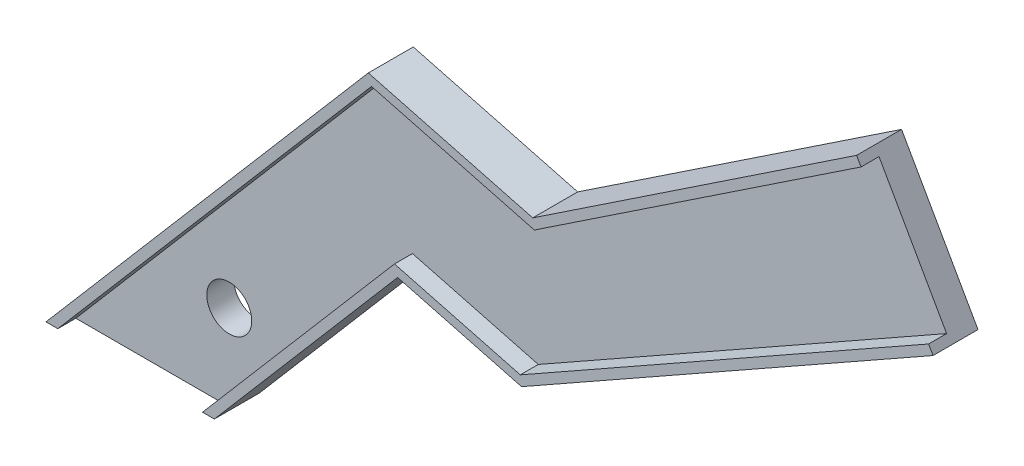
ISO-10303-21;
HEADER;
FILE_DESCRIPTION(('STEP AP214'),'2;1');
FILE_NAME('part.step','',(''),(''),'','','');
FILE_SCHEMA(('AUTOMOTIVE_DESIGN { 1 0 10303 214 1 1 1 1 }'));
ENDSEC;
DATA;
#1=APPLICATION_CONTEXT('core data for automotive mechanical design processes');
#2=APPLICATION_PROTOCOL_DEFINITION('international standard','automotive_design',2000,#1);
#3=PRODUCT_CONTEXT('',#1,'mechanical');
#4=PRODUCT('Part','Part','',(#3));
#5=PRODUCT_RELATED_PRODUCT_CATEGORY('part','',(#4));
#6=PRODUCT_DEFINITION_FORMATION('','',#4);
#7=PRODUCT_DEFINITION_CONTEXT('part definition',#1,'design');
#8=PRODUCT_DEFINITION('design','',#6,#7);
#9=PRODUCT_DEFINITION_SHAPE('','',#8);
#10=(LENGTH_UNIT() NAMED_UNIT(*) SI_UNIT(.MILLI.,.METRE.));
#11=(NAMED_UNIT(*) PLANE_ANGLE_UNIT() SI_UNIT($,.RADIAN.));
#12=(NAMED_UNIT(*) SI_UNIT($,.STERADIAN.) SOLID_ANGLE_UNIT());
#13=UNCERTAINTY_MEASURE_WITH_UNIT(LENGTH_MEASURE(1.E-05),#10,'distance_accuracy_value','');
#14=(GEOMETRIC_REPRESENTATION_CONTEXT(3) GLOBAL_UNCERTAINTY_ASSIGNED_CONTEXT((#13)) GLOBAL_UNIT_ASSIGNED_CONTEXT((#10,
#11,#12)) REPRESENTATION_CONTEXT('',''));
#15=CARTESIAN_POINT('',(0.,0.,0.));
#16=DIRECTION('',(0.,0.,1.));
#17=DIRECTION('',(1.,0.,0.));
#18=AXIS2_PLACEMENT_3D('',#15,#16,#17);
#19=CARTESIAN_POINT('',(0.,0.,10.));
#20=DIRECTION('',(0.,0.,1.));
#21=DIRECTION('',(-1.,0.,0.));
#22=AXIS2_PLACEMENT_3D('',#19,#20,#21);
#23=PLANE('',#22);
#24=DIRECTION('',(0.831851620858169,0.55499809087567,0.));
#25=VECTOR('',#24,1.);
#26=CARTESIAN_POINT('',(71.3460566451606,45.1966724435605,10.));
#27=LINE('',#26,#25);
#28=CARTESIAN_POINT('',(0.361020517094707,-2.16340782072279,10.));
#29=VERTEX_POINT('',#28);
#30=CARTESIAN_POINT('',(73.0142882611166,46.3096898841454,10.));
#31=VERTEX_POINT('',#30);
#32=EDGE_CURVE('E311',#29,#31,#27,.T.);
#33=ORIENTED_EDGE('',*,*,#32,.T.);
#34=DIRECTION('',(-0.492241162460132,0.870458866334244,0.));
#35=VECTOR('',#34,1.);
#36=CARTESIAN_POINT('',(72.0271263090322,48.0553461584098,10.));
#37=LINE('',#36,#35);
#38=CARTESIAN_POINT('',(72.0271263090322,48.0553461584098,10.));
#39=VERTEX_POINT('',#38);
#40=EDGE_CURVE('E143',#31,#39,#37,.T.);
#41=ORIENTED_EDGE('',*,*,#40,.T.);
#42=DIRECTION('',(-0.831851620858169,-0.554998090875669,0.));
#43=VECTOR('',#42,1.);
#44=CARTESIAN_POINT('',(0.,0.,10.));
#45=LINE('',#44,#43);
#46=CARTESIAN_POINT('',(0.,0.,10.));
#47=VERTEX_POINT('',#46);
#48=EDGE_CURVE('E164',#39,#47,#45,.T.);
#49=ORIENTED_EDGE('',*,*,#48,.T.);
#50=DIRECTION('',(-0.966989850169506,0.254814892950072,0.));
#51=VECTOR('',#50,1.);
#52=CARTESIAN_POINT('',(-36.5644358592779,9.63522296291781,10.));
#53=LINE('',#52,#51);
#54=CARTESIAN_POINT('',(-36.5644358592779,9.63522296291781,10.));
#55=VERTEX_POINT('',#54);
#56=EDGE_CURVE('E179',#47,#55,#53,.T.);
#57=ORIENTED_EDGE('',*,*,#56,.T.);
#58=DIRECTION('',(-0.650057725157127,-0.759884829407418,0.));
#59=VECTOR('',#58,1.);
#60=CARTESIAN_POINT('',(-108.242490342633,-74.152822460548,10.));
#61=LINE('',#60,#59);
#62=CARTESIAN_POINT('',(-108.242490342633,-74.152822460548,10.));
#63=VERTEX_POINT('',#62);
#64=EDGE_CURVE('E192',#55,#63,#61,.T.);
#65=ORIENTED_EDGE('',*,*,#64,.T.);
#66=DIRECTION('',(1.,0.,0.));
#67=VECTOR('',#66,1.);
#68=CARTESIAN_POINT('',(-70.8031079516204,-74.152822460548,10.));
#69=LINE('',#68,#67);
#70=CARTESIAN_POINT('',(-105.610512544683,-74.152822460548,10.));
#71=VERTEX_POINT('',#70);
#72=EDGE_CURVE('E202',#63,#71,#69,.T.);
#73=ORIENTED_EDGE('',*,*,#72,.T.);
#74=DIRECTION('',(0.650057725157127,0.759884829407418,0.));
#75=VECTOR('',#74,1.);
#76=CARTESIAN_POINT('',(-103.899575044683,-72.152822460548,10.));
#77=LINE('',#76,#75);
#78=CARTESIAN_POINT('',(-35.8604905500961,7.38144982536127,10.));
#79=VERTEX_POINT('',#78);
#80=EDGE_CURVE('E371',#71,#79,#77,.T.);
#81=ORIENTED_EDGE('',*,*,#80,.T.);
#82=DIRECTION('',(0.966989850169506,-0.254814892950072,0.));
#83=VECTOR('',#82,1.);
#84=CARTESIAN_POINT('',(-35.8604905500961,7.38144982536127,10.));
#85=LINE('',#84,#83);
#86=EDGE_CURVE('E368',#79,#29,#85,.T.);
#87=ORIENTED_EDGE('',*,*,#86,.T.);
#88=EDGE_LOOP('',(#33,#41,#49,#57,#65,#73,#81,#87));
#89=FACE_BOUND('',#88,.T.);
#90=ADVANCED_FACE('F37',(#89),#23,.T.);
#91=CARTESIAN_POINT('',(0.,0.,10.));
#92=DIRECTION('',(-0.554998090875669,0.831851620858169,0.));
#93=DIRECTION('',(-0.831851620858169,-0.554998090875669,0.));
#94=AXIS2_PLACEMENT_3D('',#91,#92,#93);
#95=PLANE('',#94);
#96=DIRECTION('',(-0.831851620858169,-0.554998090875669,0.));
#97=VECTOR('',#96,1.);
#98=CARTESIAN_POINT('',(0.,0.,0.));
#99=LINE('',#98,#97);
#100=CARTESIAN_POINT('',(72.0271263090322,48.0553461584098,0.));
#101=VERTEX_POINT('',#100);
#102=CARTESIAN_POINT('',(0.,0.,0.));
#103=VERTEX_POINT('',#102);
#104=EDGE_CURVE('E150',#101,#103,#99,.T.);
#105=ORIENTED_EDGE('',*,*,#104,.T.);
#106=DIRECTION('',(0.,0.,-1.));
#107=VECTOR('',#106,1.);
#108=CARTESIAN_POINT('',(0.,0.,10.));
#109=LINE('',#108,#107);
#110=EDGE_CURVE('E100',#47,#103,#109,.T.);
#111=ORIENTED_EDGE('',*,*,#110,.F.);
#112=ORIENTED_EDGE('',*,*,#48,.F.);
#113=DIRECTION('',(0.,0.,-1.));
#114=VECTOR('',#113,1.);
#115=CARTESIAN_POINT('',(72.0271263090322,48.0553461584098,10.));
#116=LINE('',#115,#114);
#117=EDGE_CURVE('E11',#39,#101,#116,.T.);
#118=ORIENTED_EDGE('',*,*,#117,.T.);
#119=EDGE_LOOP('',(#105,#111,#112,#118));
#120=FACE_BOUND('',#119,.T.);
#121=ADVANCED_FACE('F39',(#120),#95,.T.);
#122=CARTESIAN_POINT('',(72.0271263090322,48.0553461584098,10.));
#123=DIRECTION('',(0.870458866334244,0.492241162460132,0.));
#124=DIRECTION('',(-0.492241162460132,0.870458866334244,0.));
#125=AXIS2_PLACEMENT_3D('',#122,#123,#124);
#126=PLANE('',#125);
#127=DIRECTION('',(0.,0.,1.));
#128=VECTOR('',#127,1.);
#129=CARTESIAN_POINT('',(73.0142882611166,46.3096898841454,6.));
#130=LINE('',#129,#128);
#131=CARTESIAN_POINT('',(73.0142882611166,46.3096898841454,6.));
#132=VERTEX_POINT('',#131);
#133=EDGE_CURVE('E294',#132,#31,#130,.T.);
#134=ORIENTED_EDGE('',*,*,#133,.F.);
#135=DIRECTION('',(0.492241162460132,-0.870458866334244,0.));
#136=VECTOR('',#135,1.);
#137=CARTESIAN_POINT('',(88.0431597526094,19.733256545279,6.));
#138=LINE('',#137,#136);
#139=CARTESIAN_POINT('',(88.0431597526094,19.733256545279,6.));
#140=VERTEX_POINT('',#139);
#141=EDGE_CURVE('E298',#132,#140,#138,.T.);
#142=ORIENTED_EDGE('',*,*,#141,.T.);
#143=DIRECTION('',(0.,0.,1.));
#144=VECTOR('',#143,1.);
#145=CARTESIAN_POINT('',(88.0431597526094,19.733256545279,6.));
#146=LINE('',#145,#144);
#147=CARTESIAN_POINT('',(88.0431597526095,19.733256545279,10.));
#148=VERTEX_POINT('',#147);
#149=EDGE_CURVE('E325',#140,#148,#146,.T.);
#150=ORIENTED_EDGE('',*,*,#149,.T.);
#151=CARTESIAN_POINT('',(89.0276420775297,17.9923388126105,10.));
#152=VERTEX_POINT('',#151);
#153=EDGE_CURVE('E146',#152,#148,#37,.T.);
#154=ORIENTED_EDGE('',*,*,#153,.F.);
#155=DIRECTION('',(0.,0.,-1.));
#156=VECTOR('',#155,1.);
#157=CARTESIAN_POINT('',(89.0276420775297,17.9923388126105,10.));
#158=LINE('',#157,#156);
#159=CARTESIAN_POINT('',(89.0276420775297,17.9923388126105,0.));
#160=VERTEX_POINT('',#159);
#161=EDGE_CURVE('E46',#152,#160,#158,.T.);
#162=ORIENTED_EDGE('',*,*,#161,.T.);
#163=DIRECTION('',(-0.492241162460132,0.870458866334244,0.));
#164=VECTOR('',#163,1.);
#165=CARTESIAN_POINT('',(72.0271263090322,48.0553461584098,0.));
#166=LINE('',#165,#164);
#167=EDGE_CURVE('E93',#160,#101,#166,.T.);
#168=ORIENTED_EDGE('',*,*,#167,.T.);
#169=ORIENTED_EDGE('',*,*,#117,.F.);
#170=ORIENTED_EDGE('',*,*,#40,.F.);
#171=EDGE_LOOP('',(#134,#142,#150,#154,#162,#168,#169,#170));
#172=FACE_BOUND('',#171,.T.);
#173=ADVANCED_FACE('F231',(#172),#126,.T.);
#174=CARTESIAN_POINT('',(89.0276420775297,17.9923388126105,10.));
#175=DIRECTION('',(0.492241162460132,-0.870458866334245,0.));
#176=DIRECTION('',(0.870458866334244,0.492241162460132,0.));
#177=AXIS2_PLACEMENT_3D('',#174,#175,#176);
#178=PLANE('',#177);
#179=DIRECTION('',(0.870458866334245,0.492241162460132,0.));
#180=VECTOR('',#179,1.);
#181=CARTESIAN_POINT('',(89.0276420775297,17.9923388126105,0.));
#182=LINE('',#181,#180);
#183=CARTESIAN_POINT('',(-2.4874686618368,-33.7591065862073,0.));
#184=VERTEX_POINT('',#183);
#185=EDGE_CURVE('E162',#184,#160,#182,.T.);
#186=ORIENTED_EDGE('',*,*,#185,.T.);
#187=ORIENTED_EDGE('',*,*,#161,.F.);
#188=DIRECTION('',(0.870458866334245,0.492241162460132,0.));
#189=VECTOR('',#188,1.);
#190=CARTESIAN_POINT('',(89.0276420775297,17.9923388126105,10.));
#191=LINE('',#190,#189);
#192=CARTESIAN_POINT('',(-2.4874686618368,-33.7591065862073,10.));
#193=VERTEX_POINT('',#192);
#194=EDGE_CURVE('E124',#193,#152,#191,.T.);
#195=ORIENTED_EDGE('',*,*,#194,.F.);
#196=DIRECTION('',(0.,0.,-1.));
#197=VECTOR('',#196,1.);
#198=CARTESIAN_POINT('',(-2.4874686618368,-33.7591065862073,10.));
#199=LINE('',#198,#197);
#200=EDGE_CURVE('E133',#193,#184,#199,.T.);
#201=ORIENTED_EDGE('',*,*,#200,.T.);
#202=EDGE_LOOP('',(#186,#187,#195,#201));
#203=FACE_BOUND('',#202,.T.);
#204=ADVANCED_FACE('F141',(#203),#178,.T.);
#205=CARTESIAN_POINT('',(-2.4874686618368,-33.7591065862073,10.));
#206=DIRECTION('',(-0.254814892950072,-0.966989850169506,0.));
#207=DIRECTION('',(0.966989850169506,-0.254814892950072,0.));
#208=AXIS2_PLACEMENT_3D('',#205,#206,#207);
#209=PLANE('',#208);
#210=DIRECTION('',(0.966989850169506,-0.254814892950072,0.));
#211=VECTOR('',#210,1.);
#212=CARTESIAN_POINT('',(-2.4874686618368,-33.7591065862073,0.));
#213=LINE('',#212,#211);
#214=CARTESIAN_POINT('',(-30.0370997650738,-26.4994064981922,0.));
#215=VERTEX_POINT('',#214);
#216=EDGE_CURVE('E136',#215,#184,#213,.T.);
#217=ORIENTED_EDGE('',*,*,#216,.T.);
#218=ORIENTED_EDGE('',*,*,#200,.F.);
#219=DIRECTION('',(0.966989850169506,-0.254814892950072,0.));
#220=VECTOR('',#219,1.);
#221=CARTESIAN_POINT('',(-2.4874686618368,-33.7591065862073,10.));
#222=LINE('',#221,#220);
#223=CARTESIAN_POINT('',(-30.0370997650738,-26.4994064981922,10.));
#224=VERTEX_POINT('',#223);
#225=EDGE_CURVE('E119',#224,#193,#222,.T.);
#226=ORIENTED_EDGE('',*,*,#225,.F.);
#227=DIRECTION('',(0.,0.,-1.));
#228=VECTOR('',#227,1.);
#229=CARTESIAN_POINT('',(-30.0370997650738,-26.4994064981922,10.));
#230=LINE('',#229,#228);
#231=EDGE_CURVE('E139',#224,#215,#230,.T.);
#232=ORIENTED_EDGE('',*,*,#231,.T.);
#233=EDGE_LOOP('',(#217,#218,#226,#232));
#234=FACE_BOUND('',#233,.T.);
#235=ADVANCED_FACE('F134',(#234),#209,.T.);
#236=CARTESIAN_POINT('',(-30.0370997650738,-26.4994064981922,10.));
#237=DIRECTION('',(0.759884829407418,-0.650057725157127,0.));
#238=DIRECTION('',(0.650057725157127,0.759884829407418,0.));
#239=AXIS2_PLACEMENT_3D('',#236,#237,#238);
#240=PLANE('',#239);
#241=DIRECTION('',(0.650057725157127,0.759884829407418,0.));
#242=VECTOR('',#241,1.);
#243=CARTESIAN_POINT('',(-30.0370997650738,-26.4994064981922,0.));
#244=LINE('',#243,#242);
#245=CARTESIAN_POINT('',(-70.8031079516204,-74.152822460548,0.));
#246=VERTEX_POINT('',#245);
#247=EDGE_CURVE('E159',#246,#215,#244,.T.);
#248=ORIENTED_EDGE('',*,*,#247,.T.);
#249=ORIENTED_EDGE('',*,*,#231,.F.);
#250=DIRECTION('',(0.650057725157127,0.759884829407418,0.));
#251=VECTOR('',#250,1.);
#252=CARTESIAN_POINT('',(-30.0370997650738,-26.4994064981922,10.));
#253=LINE('',#252,#251);
#254=CARTESIAN_POINT('',(-70.8031079516204,-74.152822460548,10.));
#255=VERTEX_POINT('',#254);
#256=EDGE_CURVE('E127',#255,#224,#253,.T.);
#257=ORIENTED_EDGE('',*,*,#256,.F.);
#258=DIRECTION('',(0.,0.,-1.));
#259=VECTOR('',#258,1.);
#260=CARTESIAN_POINT('',(-70.8031079516204,-74.152822460548,10.));
#261=LINE('',#260,#259);
#262=EDGE_CURVE('E168',#255,#246,#261,.T.);
#263=ORIENTED_EDGE('',*,*,#262,.T.);
#264=EDGE_LOOP('',(#248,#249,#257,#263));
#265=FACE_BOUND('',#264,.T.);
#266=ADVANCED_FACE('F217',(#265),#240,.T.);
#267=CARTESIAN_POINT('',(-70.8031079516204,-74.152822460548,10.));
#268=DIRECTION('',(0.,-1.,0.));
#269=DIRECTION('',(0.,0.,1.));
#270=AXIS2_PLACEMENT_3D('',#267,#268,#269);
#271=PLANE('',#270);
#272=DIRECTION('',(0.,0.,1.));
#273=VECTOR('',#272,1.);
#274=CARTESIAN_POINT('',(-105.610512544683,-74.152822460548,6.));
#275=LINE('',#274,#273);
#276=CARTESIAN_POINT('',(-105.610512544683,-74.152822460548,6.));
#277=VERTEX_POINT('',#276);
#278=EDGE_CURVE('E316',#277,#71,#275,.T.);
#279=ORIENTED_EDGE('',*,*,#278,.T.);
#280=ORIENTED_EDGE('',*,*,#72,.F.);
#281=DIRECTION('',(0.,0.,-1.));
#282=VECTOR('',#281,1.);
#283=CARTESIAN_POINT('',(-108.242490342633,-74.152822460548,10.));
#284=LINE('',#283,#282);
#285=CARTESIAN_POINT('',(-108.242490342633,-74.152822460548,0.));
#286=VERTEX_POINT('',#285);
#287=EDGE_CURVE('E171',#63,#286,#284,.T.);
#288=ORIENTED_EDGE('',*,*,#287,.T.);
#289=DIRECTION('',(1.,0.,0.));
#290=VECTOR('',#289,1.);
#291=CARTESIAN_POINT('',(-70.8031079516204,-74.152822460548,0.));
#292=LINE('',#291,#290);
#293=EDGE_CURVE('E157',#286,#246,#292,.T.);
#294=ORIENTED_EDGE('',*,*,#293,.T.);
#295=ORIENTED_EDGE('',*,*,#262,.F.);
#296=CARTESIAN_POINT('',(-73.4350857495712,-74.152822460548,10.));
#297=VERTEX_POINT('',#296);
#298=EDGE_CURVE('E195',#297,#255,#69,.T.);
#299=ORIENTED_EDGE('',*,*,#298,.F.);
#300=DIRECTION('',(0.,0.,1.));
#301=VECTOR('',#300,1.);
#302=CARTESIAN_POINT('',(-73.4350857495712,-74.152822460548,6.));
#303=LINE('',#302,#301);
#304=CARTESIAN_POINT('',(-73.4350857495712,-74.152822460548,6.));
#305=VERTEX_POINT('',#304);
#306=EDGE_CURVE('E318',#305,#297,#303,.T.);
#307=ORIENTED_EDGE('',*,*,#306,.F.);
#308=DIRECTION('',(-1.,0.,0.));
#309=VECTOR('',#308,1.);
#310=CARTESIAN_POINT('',(-73.4350857495712,-74.152822460548,6.));
#311=LINE('',#310,#309);
#312=EDGE_CURVE('E385',#305,#277,#311,.T.);
#313=ORIENTED_EDGE('',*,*,#312,.T.);
#314=EDGE_LOOP('',(#279,#280,#288,#294,#295,#299,#307,#313));
#315=FACE_BOUND('',#314,.T.);
#316=ADVANCED_FACE('F215',(#315),#271,.T.);
#317=CARTESIAN_POINT('',(-108.242490342633,-74.152822460548,10.));
#318=DIRECTION('',(-0.759884829407418,0.650057725157127,0.));
#319=DIRECTION('',(-0.650057725157127,-0.759884829407418,0.));
#320=AXIS2_PLACEMENT_3D('',#317,#318,#319);
#321=PLANE('',#320);
#322=DIRECTION('',(-0.650057725157127,-0.759884829407418,0.));
#323=VECTOR('',#322,1.);
#324=CARTESIAN_POINT('',(-108.242490342633,-74.152822460548,0.));
#325=LINE('',#324,#323);
#326=CARTESIAN_POINT('',(-36.5644358592779,9.63522296291781,0.));
#327=VERTEX_POINT('',#326);
#328=EDGE_CURVE('E155',#327,#286,#325,.T.);
#329=ORIENTED_EDGE('',*,*,#328,.T.);
#330=ORIENTED_EDGE('',*,*,#287,.F.);
#331=ORIENTED_EDGE('',*,*,#64,.F.);
#332=DIRECTION('',(0.,0.,-1.));
#333=VECTOR('',#332,1.);
#334=CARTESIAN_POINT('',(-36.5644358592779,9.63522296291781,10.));
#335=LINE('',#334,#333);
#336=EDGE_CURVE('E174',#55,#327,#335,.T.);
#337=ORIENTED_EDGE('',*,*,#336,.T.);
#338=EDGE_LOOP('',(#329,#330,#331,#337));
#339=FACE_BOUND('',#338,.T.);
#340=ADVANCED_FACE('F188',(#339),#321,.T.);
#341=CARTESIAN_POINT('',(-36.5644358592779,9.63522296291781,10.));
#342=DIRECTION('',(0.254814892950072,0.966989850169506,0.));
#343=DIRECTION('',(-0.966989850169506,0.254814892950072,0.));
#344=AXIS2_PLACEMENT_3D('',#341,#342,#343);
#345=PLANE('',#344);
#346=DIRECTION('',(-0.966989850169506,0.254814892950072,0.));
#347=VECTOR('',#346,1.);
#348=CARTESIAN_POINT('',(-36.5644358592779,9.63522296291781,0.));
#349=LINE('',#348,#347);
#350=EDGE_CURVE('E152',#103,#327,#349,.T.);
#351=ORIENTED_EDGE('',*,*,#350,.T.);
#352=ORIENTED_EDGE('',*,*,#336,.F.);
#353=ORIENTED_EDGE('',*,*,#56,.F.);
#354=ORIENTED_EDGE('',*,*,#110,.T.);
#355=EDGE_LOOP('',(#351,#352,#353,#354));
#356=FACE_BOUND('',#355,.T.);
#357=ADVANCED_FACE('F177',(#356),#345,.T.);
#358=DIRECTION('',(-0.650057725157126,-0.759884829407419,0.));
#359=VECTOR('',#358,1.);
#360=CARTESIAN_POINT('',(-71.7241482495712,-72.152822460548,10.));
#361=LINE('',#360,#359);
#362=CARTESIAN_POINT('',(-30.7410450742555,-24.2456333606356,10.));
#363=VERTEX_POINT('',#362);
#364=EDGE_CURVE('E210',#363,#297,#361,.T.);
#365=ORIENTED_EDGE('',*,*,#364,.T.);
#366=ORIENTED_EDGE('',*,*,#298,.T.);
#367=ORIENTED_EDGE('',*,*,#256,.T.);
#368=ORIENTED_EDGE('',*,*,#225,.T.);
#369=ORIENTED_EDGE('',*,*,#194,.T.);
#370=ORIENTED_EDGE('',*,*,#153,.T.);
#371=DIRECTION('',(-0.870458866334244,-0.492241162460132,0.));
#372=VECTOR('',#371,1.);
#373=CARTESIAN_POINT('',(86.3022420199409,18.7487742203587,10.));
#374=LINE('',#373,#372);
#375=CARTESIAN_POINT('',(-2.76414177146878,-31.6179254471808,10.));
#376=VERTEX_POINT('',#375);
#377=EDGE_CURVE('E54',#148,#376,#374,.T.);
#378=ORIENTED_EDGE('',*,*,#377,.T.);
#379=DIRECTION('',(-0.966989850169506,0.254814892950072,0.));
#380=VECTOR('',#379,1.);
#381=CARTESIAN_POINT('',(-2.76414177146878,-31.6179254471808,10.));
#382=LINE('',#381,#380);
#383=EDGE_CURVE('E376',#376,#363,#382,.T.);
#384=ORIENTED_EDGE('',*,*,#383,.T.);
#385=EDGE_LOOP('',(#365,#366,#367,#368,#369,#370,#378,#384));
#386=FACE_BOUND('',#385,.T.);
#387=ADVANCED_FACE('F122',(#386),#23,.T.);
#388=CARTESIAN_POINT('',(0.,0.,0.));
#389=DIRECTION('',(0.,0.,1.));
#390=DIRECTION('',(-1.,0.,0.));
#391=AXIS2_PLACEMENT_3D('',#388,#389,#390);
#392=PLANE('',#391);
#393=CARTESIAN_POINT('',(-71.490774549545,-55.1047281037053,0.));
#394=DIRECTION('',(0.,0.,1.));
#395=DIRECTION('',(1.,0.,0.));
#396=AXIS2_PLACEMENT_3D('',#393,#394,#395);
#397=CIRCLE('',#396,5.00000000000001);
#398=CARTESIAN_POINT('',(-66.490774549545,-55.1047281037053,0.));
#399=VERTEX_POINT('',#398);
#400=EDGE_CURVE('E153',#399,#399,#397,.T.);
#401=ORIENTED_EDGE('',*,*,#400,.T.);
#402=EDGE_LOOP('',(#401));
#403=FACE_BOUND('',#402,.T.);
#404=ORIENTED_EDGE('',*,*,#104,.F.);
#405=ORIENTED_EDGE('',*,*,#167,.F.);
#406=ORIENTED_EDGE('',*,*,#185,.F.);
#407=ORIENTED_EDGE('',*,*,#216,.F.);
#408=ORIENTED_EDGE('',*,*,#247,.F.);
#409=ORIENTED_EDGE('',*,*,#293,.F.);
#410=ORIENTED_EDGE('',*,*,#328,.F.);
#411=ORIENTED_EDGE('',*,*,#350,.F.);
#412=EDGE_LOOP('',(#404,#405,#406,#407,#408,#409,#410,#411));
#413=FACE_BOUND('',#412,.T.);
#414=ADVANCED_FACE('F183',(#403,#413),#392,.F.);
#415=CARTESIAN_POINT('',(-71.490774549545,-55.1047281037053,10.));
#416=DIRECTION('',(0.,0.,-1.));
#417=DIRECTION('',(1.,0.,0.));
#418=AXIS2_PLACEMENT_3D('',#415,#416,#417);
#419=CYLINDRICAL_SURFACE('',#418,5.00000000000001);
#420=CARTESIAN_POINT('',(-71.490774549545,-55.1047281037053,6.));
#421=DIRECTION('',(0.,0.,1.));
#422=DIRECTION('',(1.,0.,0.));
#423=AXIS2_PLACEMENT_3D('',#420,#421,#422);
#424=CIRCLE('',#423,5.00000000000001);
#425=CARTESIAN_POINT('',(-66.490774549545,-55.1047281037053,6.));
#426=VERTEX_POINT('',#425);
#427=EDGE_CURVE('E41',#426,#426,#424,.F.);
#428=ORIENTED_EDGE('',*,*,#427,.F.);
#429=EDGE_LOOP('',(#428));
#430=FACE_BOUND('',#429,.T.);
#431=ORIENTED_EDGE('',*,*,#400,.F.);
#432=EDGE_LOOP('',(#431));
#433=FACE_BOUND('',#432,.T.);
#434=ADVANCED_FACE('F239',(#430,#433),#419,.F.);
#435=CARTESIAN_POINT('',(0.,0.,6.));
#436=DIRECTION('',(0.,0.,-1.));
#437=DIRECTION('',(1.,0.,0.));
#438=AXIS2_PLACEMENT_3D('',#435,#436,#437);
#439=PLANE('',#438);
#440=ORIENTED_EDGE('',*,*,#141,.F.);
#441=DIRECTION('',(0.831851620858169,0.554998090875669,0.));
#442=VECTOR('',#441,1.);
#443=CARTESIAN_POINT('',(0.361020517094707,-2.16340782072279,6.));
#444=LINE('',#443,#442);
#445=CARTESIAN_POINT('',(0.361020517094707,-2.16340782072279,6.));
#446=VERTEX_POINT('',#445);
#447=EDGE_CURVE('E326',#446,#132,#444,.T.);
#448=ORIENTED_EDGE('',*,*,#447,.F.);
#449=DIRECTION('',(0.966989850169506,-0.254814892950072,0.));
#450=VECTOR('',#449,1.);
#451=CARTESIAN_POINT('',(-35.8604905500961,7.38144982536127,6.));
#452=LINE('',#451,#450);
#453=CARTESIAN_POINT('',(-35.8604905500961,7.38144982536127,6.));
#454=VERTEX_POINT('',#453);
#455=EDGE_CURVE('E380',#454,#446,#452,.T.);
#456=ORIENTED_EDGE('',*,*,#455,.F.);
#457=DIRECTION('',(0.650057725157126,0.759884829407419,0.));
#458=VECTOR('',#457,1.);
#459=CARTESIAN_POINT('',(-103.899575044683,-72.152822460548,6.));
#460=LINE('',#459,#458);
#461=EDGE_CURVE('E382',#277,#454,#460,.T.);
#462=ORIENTED_EDGE('',*,*,#461,.F.);
#463=ORIENTED_EDGE('',*,*,#312,.F.);
#464=DIRECTION('',(-0.650057725157127,-0.759884829407418,0.));
#465=VECTOR('',#464,1.);
#466=CARTESIAN_POINT('',(-30.7410450742555,-24.2456333606356,6.));
#467=LINE('',#466,#465);
#468=CARTESIAN_POINT('',(-30.7410450742555,-24.2456333606356,6.));
#469=VERTEX_POINT('',#468);
#470=EDGE_CURVE('E388',#469,#305,#467,.T.);
#471=ORIENTED_EDGE('',*,*,#470,.F.);
#472=DIRECTION('',(-0.966989850169506,0.254814892950072,0.));
#473=VECTOR('',#472,1.);
#474=CARTESIAN_POINT('',(-2.76414177146878,-31.6179254471808,6.));
#475=LINE('',#474,#473);
#476=CARTESIAN_POINT('',(-2.76414177146878,-31.6179254471808,6.));
#477=VERTEX_POINT('',#476);
#478=EDGE_CURVE('E391',#477,#469,#475,.T.);
#479=ORIENTED_EDGE('',*,*,#478,.F.);
#480=DIRECTION('',(-0.870458866334244,-0.492241162460132,0.));
#481=VECTOR('',#480,1.);
#482=CARTESIAN_POINT('',(86.3022420199409,18.7487742203587,6.));
#483=LINE('',#482,#481);
#484=EDGE_CURVE('E369',#140,#477,#483,.T.);
#485=ORIENTED_EDGE('',*,*,#484,.F.);
#486=EDGE_LOOP('',(#440,#448,#456,#462,#463,#471,#479,#485));
#487=FACE_BOUND('',#486,.T.);
#488=ORIENTED_EDGE('',*,*,#427,.T.);
#489=EDGE_LOOP('',(#488));
#490=FACE_BOUND('',#489,.T.);
#491=ADVANCED_FACE('F331',(#487,#490),#439,.F.);
#492=CARTESIAN_POINT('',(71.3460566451606,45.1966724435605,6.));
#493=DIRECTION('',(-0.55499809087567,0.831851620858169,0.));
#494=DIRECTION('',(-0.831851620858169,-0.55499809087567,0.));
#495=AXIS2_PLACEMENT_3D('',#492,#493,#494);
#496=PLANE('',#495);
#497=ORIENTED_EDGE('',*,*,#32,.F.);
#498=DIRECTION('',(0.,0.,1.));
#499=VECTOR('',#498,1.);
#500=CARTESIAN_POINT('',(0.361020517094707,-2.16340782072279,6.));
#501=LINE('',#500,#499);
#502=EDGE_CURVE('E304',#446,#29,#501,.T.);
#503=ORIENTED_EDGE('',*,*,#502,.F.);
#504=ORIENTED_EDGE('',*,*,#447,.T.);
#505=ORIENTED_EDGE('',*,*,#133,.T.);
#506=EDGE_LOOP('',(#497,#503,#504,#505));
#507=FACE_BOUND('',#506,.T.);
#508=ADVANCED_FACE('F336',(#507),#496,.F.);
#509=CARTESIAN_POINT('',(-35.8604905500961,7.38144982536127,6.));
#510=DIRECTION('',(0.254814892950072,0.966989850169506,0.));
#511=DIRECTION('',(-0.966989850169506,0.254814892950072,0.));
#512=AXIS2_PLACEMENT_3D('',#509,#510,#511);
#513=PLANE('',#512);
#514=ORIENTED_EDGE('',*,*,#86,.F.);
#515=DIRECTION('',(0.,0.,1.));
#516=VECTOR('',#515,1.);
#517=CARTESIAN_POINT('',(-35.8604905500961,7.38144982536127,6.));
#518=LINE('',#517,#516);
#519=EDGE_CURVE('E308',#454,#79,#518,.T.);
#520=ORIENTED_EDGE('',*,*,#519,.F.);
#521=ORIENTED_EDGE('',*,*,#455,.T.);
#522=ORIENTED_EDGE('',*,*,#502,.T.);
#523=EDGE_LOOP('',(#514,#520,#521,#522));
#524=FACE_BOUND('',#523,.T.);
#525=ADVANCED_FACE('F355',(#524),#513,.F.);
#526=CARTESIAN_POINT('',(-103.899575044683,-72.152822460548,6.));
#527=DIRECTION('',(-0.759884829407418,0.650057725157127,0.));
#528=DIRECTION('',(-0.650057725157127,-0.759884829407418,0.));
#529=AXIS2_PLACEMENT_3D('',#526,#527,#528);
#530=PLANE('',#529);
#531=ORIENTED_EDGE('',*,*,#80,.F.);
#532=ORIENTED_EDGE('',*,*,#278,.F.);
#533=ORIENTED_EDGE('',*,*,#461,.T.);
#534=ORIENTED_EDGE('',*,*,#519,.T.);
#535=EDGE_LOOP('',(#531,#532,#533,#534));
#536=FACE_BOUND('',#535,.T.);
#537=ADVANCED_FACE('F351',(#536),#530,.F.);
#538=CARTESIAN_POINT('',(-71.7241482495712,-72.152822460548,6.));
#539=DIRECTION('',(0.759884829407419,-0.650057725157126,0.));
#540=DIRECTION('',(0.650057725157126,0.759884829407419,0.));
#541=AXIS2_PLACEMENT_3D('',#538,#539,#540);
#542=PLANE('',#541);
#543=ORIENTED_EDGE('',*,*,#364,.F.);
#544=DIRECTION('',(0.,0.,1.));
#545=VECTOR('',#544,1.);
#546=CARTESIAN_POINT('',(-30.7410450742555,-24.2456333606356,6.));
#547=LINE('',#546,#545);
#548=EDGE_CURVE('E320',#469,#363,#547,.T.);
#549=ORIENTED_EDGE('',*,*,#548,.F.);
#550=ORIENTED_EDGE('',*,*,#470,.T.);
#551=ORIENTED_EDGE('',*,*,#306,.T.);
#552=EDGE_LOOP('',(#543,#549,#550,#551));
#553=FACE_BOUND('',#552,.T.);
#554=ADVANCED_FACE('F347',(#553),#542,.F.);
#555=CARTESIAN_POINT('',(-2.76414177146878,-31.6179254471808,6.));
#556=DIRECTION('',(-0.254814892950072,-0.966989850169506,0.));
#557=DIRECTION('',(0.966989850169506,-0.254814892950072,0.));
#558=AXIS2_PLACEMENT_3D('',#555,#556,#557);
#559=PLANE('',#558);
#560=ORIENTED_EDGE('',*,*,#383,.F.);
#561=DIRECTION('',(0.,0.,1.));
#562=VECTOR('',#561,1.);
#563=CARTESIAN_POINT('',(-2.76414177146878,-31.6179254471808,6.));
#564=LINE('',#563,#562);
#565=EDGE_CURVE('E323',#477,#376,#564,.T.);
#566=ORIENTED_EDGE('',*,*,#565,.F.);
#567=ORIENTED_EDGE('',*,*,#478,.T.);
#568=ORIENTED_EDGE('',*,*,#548,.T.);
#569=EDGE_LOOP('',(#560,#566,#567,#568));
#570=FACE_BOUND('',#569,.T.);
#571=ADVANCED_FACE('F344',(#570),#559,.F.);
#572=CARTESIAN_POINT('',(86.3022420199409,18.7487742203587,6.));
#573=DIRECTION('',(0.492241162460132,-0.870458866334244,0.));
#574=DIRECTION('',(0.870458866334245,0.492241162460132,0.));
#575=AXIS2_PLACEMENT_3D('',#572,#573,#574);
#576=PLANE('',#575);
#577=ORIENTED_EDGE('',*,*,#377,.F.);
#578=ORIENTED_EDGE('',*,*,#149,.F.);
#579=ORIENTED_EDGE('',*,*,#484,.T.);
#580=ORIENTED_EDGE('',*,*,#565,.T.);
#581=EDGE_LOOP('',(#577,#578,#579,#580));
#582=FACE_BOUND('',#581,.T.);
#583=ADVANCED_FACE('F341',(#582),#576,.F.);
#584=CLOSED_SHELL('',(#90,#121,#173,#204,#235,#266,#316,#340,#357,#387,#414,#434,#491,#508,#525,
#537,#554,#571,#583));
#585=MANIFOLD_SOLID_BREP('B2',#584);
#586=ADVANCED_BREP_SHAPE_REPRESENTATION('',(#18,#585),#14);
#587=SHAPE_DEFINITION_REPRESENTATION(#9,#586);
ENDSEC;
END-ISO-10303-21;
